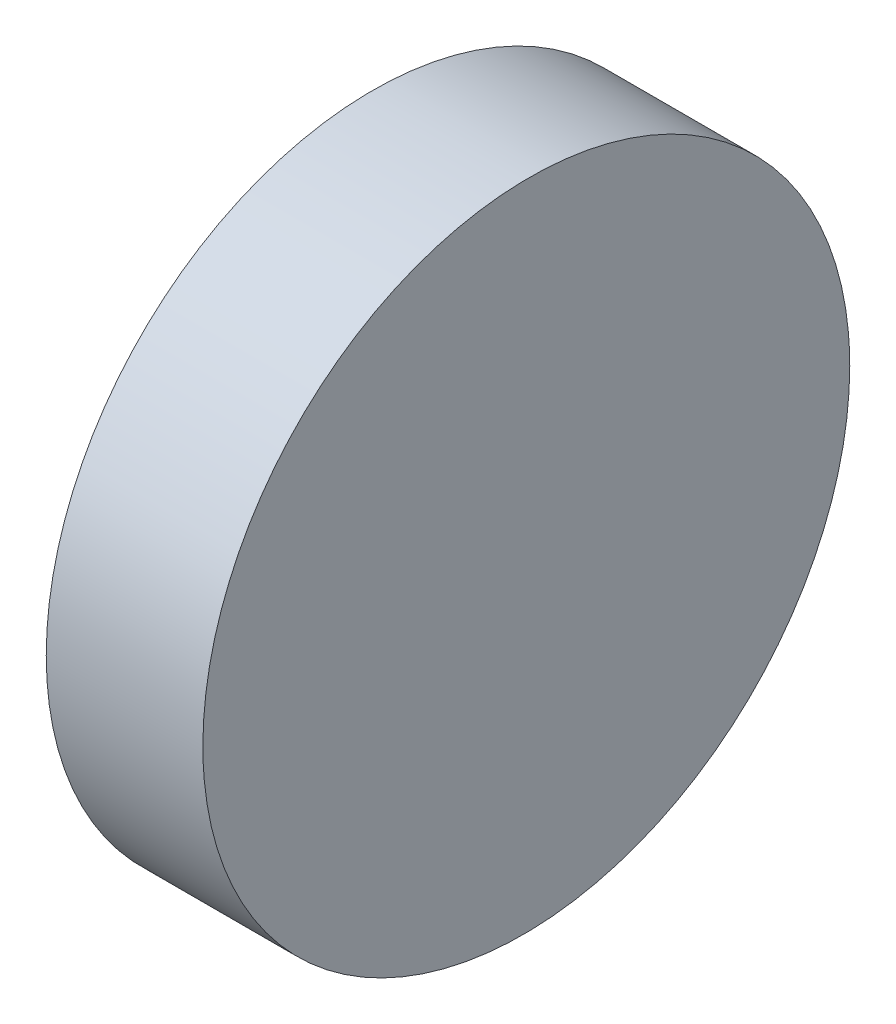
ISO-10303-21;
HEADER;
FILE_DESCRIPTION(('STEP AP214'),'2;1');
FILE_NAME('part.step','',(''),(''),'','','');
FILE_SCHEMA(('AUTOMOTIVE_DESIGN { 1 0 10303 214 1 1 1 1 }'));
ENDSEC;
DATA;
#1=APPLICATION_CONTEXT('core data for automotive mechanical design processes');
#2=APPLICATION_PROTOCOL_DEFINITION('international standard','automotive_design',2000,#1);
#3=PRODUCT_CONTEXT('',#1,'mechanical');
#4=PRODUCT('Part','Part','',(#3));
#5=PRODUCT_RELATED_PRODUCT_CATEGORY('part','',(#4));
#6=PRODUCT_DEFINITION_FORMATION('','',#4);
#7=PRODUCT_DEFINITION_CONTEXT('part definition',#1,'design');
#8=PRODUCT_DEFINITION('design','',#6,#7);
#9=PRODUCT_DEFINITION_SHAPE('','',#8);
#10=(LENGTH_UNIT() NAMED_UNIT(*) SI_UNIT(.MILLI.,.METRE.));
#11=(NAMED_UNIT(*) PLANE_ANGLE_UNIT() SI_UNIT($,.RADIAN.));
#12=(NAMED_UNIT(*) SI_UNIT($,.STERADIAN.) SOLID_ANGLE_UNIT());
#13=UNCERTAINTY_MEASURE_WITH_UNIT(LENGTH_MEASURE(1.E-05),#10,'distance_accuracy_value','');
#14=(GEOMETRIC_REPRESENTATION_CONTEXT(3) GLOBAL_UNCERTAINTY_ASSIGNED_CONTEXT((#13)) GLOBAL_UNIT_ASSIGNED_CONTEXT((#10,
#11,#12)) REPRESENTATION_CONTEXT('',''));
#15=CARTESIAN_POINT('',(0.,0.,0.));
#16=DIRECTION('',(0.,0.,1.));
#17=DIRECTION('',(1.,0.,0.));
#18=AXIS2_PLACEMENT_3D('',#15,#16,#17);
#19=CARTESIAN_POINT('',(0.,12.5,-6.25));
#20=DIRECTION('',(1.,0.,0.));
#21=DIRECTION('',(0.,0.,-1.));
#22=AXIS2_PLACEMENT_3D('',#19,#20,#21);
#23=PLANE('',#22);
#24=CARTESIAN_POINT('',(0.,6.25,0.));
#25=DIRECTION('',(-1.,0.,0.));
#26=DIRECTION('',(0.,0.,1.));
#27=AXIS2_PLACEMENT_3D('',#24,#25,#26);
#28=CIRCLE('',#27,6.25);
#29=CARTESIAN_POINT('',(0.,6.25,6.25));
#30=VERTEX_POINT('',#29);
#31=EDGE_CURVE('E39',#30,#30,#28,.T.);
#32=ORIENTED_EDGE('',*,*,#31,.T.);
#33=EDGE_LOOP('',(#32));
#34=FACE_BOUND('',#33,.T.);
#35=ADVANCED_FACE('F33',(#34),#23,.F.);
#36=CARTESIAN_POINT('',(3.,12.5,6.25));
#37=DIRECTION('',(-0.999961923064171,0.,0.00872653549836698));
#38=DIRECTION('',(0.00872653549836698,0.,0.999961923064171));
#39=AXIS2_PLACEMENT_3D('',#36,#37,#38);
#40=PLANE('',#39);
#41=CARTESIAN_POINT('',(2.9454570763078,6.25,0.));
#42=DIRECTION('',(-0.999961923064171,0.,0.00872653549836698));
#43=DIRECTION('',(-0.00872653549836698,0.,-0.999961923064171));
#44=AXIS2_PLACEMENT_3D('',#41,#42,#43);
#45=ELLIPSE('',#44,6.25023798991085,6.25);
#46=CARTESIAN_POINT('',(2.89091415261561,6.25,-6.25));
#47=VERTEX_POINT('',#46);
#48=EDGE_CURVE('E10',#47,#47,#45,.T.);
#49=ORIENTED_EDGE('',*,*,#48,.F.);
#50=EDGE_LOOP('',(#49));
#51=FACE_BOUND('',#50,.T.);
#52=ADVANCED_FACE('F48',(#51),#40,.F.);
#53=CARTESIAN_POINT('',(12.5,6.25,0.));
#54=DIRECTION('',(-1.,0.,0.));
#55=DIRECTION('',(0.,0.,1.));
#56=AXIS2_PLACEMENT_3D('',#53,#54,#55);
#57=CYLINDRICAL_SURFACE('',#56,6.25);
#58=ORIENTED_EDGE('',*,*,#31,.F.);
#59=EDGE_LOOP('',(#58));
#60=FACE_BOUND('',#59,.T.);
#61=ORIENTED_EDGE('',*,*,#48,.T.);
#62=EDGE_LOOP('',(#61));
#63=FACE_BOUND('',#62,.T.);
#64=ADVANCED_FACE('F46',(#60,#63),#57,.T.);
#65=CLOSED_SHELL('',(#35,#52,#64));
#66=MANIFOLD_SOLID_BREP('B2',#65);
#67=ADVANCED_BREP_SHAPE_REPRESENTATION('',(#18,#66),#14);
#68=SHAPE_DEFINITION_REPRESENTATION(#9,#67);
ENDSEC;
END-ISO-10303-21;
